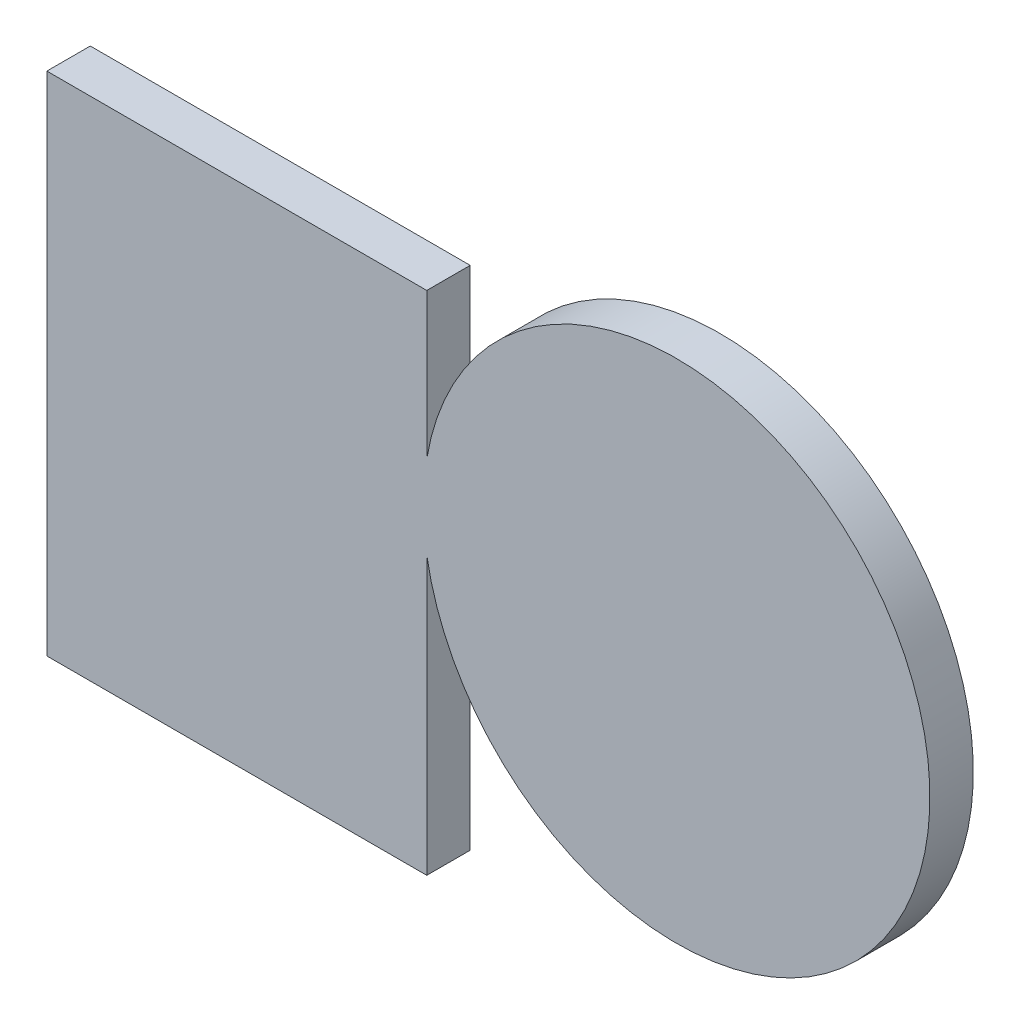
ISO-10303-21;
HEADER;
FILE_DESCRIPTION(('STEP AP214'),'2;1');
FILE_NAME('part.step','',(''),(''),'','','');
FILE_SCHEMA(('AUTOMOTIVE_DESIGN { 1 0 10303 214 1 1 1 1 }'));
ENDSEC;
DATA;
#1=APPLICATION_CONTEXT('core data for automotive mechanical design processes');
#2=APPLICATION_PROTOCOL_DEFINITION('international standard','automotive_design',2000,#1);
#3=PRODUCT_CONTEXT('',#1,'mechanical');
#4=PRODUCT('Part','Part','',(#3));
#5=PRODUCT_RELATED_PRODUCT_CATEGORY('part','',(#4));
#6=PRODUCT_DEFINITION_FORMATION('','',#4);
#7=PRODUCT_DEFINITION_CONTEXT('part definition',#1,'design');
#8=PRODUCT_DEFINITION('design','',#6,#7);
#9=PRODUCT_DEFINITION_SHAPE('','',#8);
#10=(LENGTH_UNIT() NAMED_UNIT(*) SI_UNIT(.MILLI.,.METRE.));
#11=(NAMED_UNIT(*) PLANE_ANGLE_UNIT() SI_UNIT($,.RADIAN.));
#12=(NAMED_UNIT(*) SI_UNIT($,.STERADIAN.) SOLID_ANGLE_UNIT());
#13=UNCERTAINTY_MEASURE_WITH_UNIT(LENGTH_MEASURE(1.E-05),#10,'distance_accuracy_value','');
#14=(GEOMETRIC_REPRESENTATION_CONTEXT(3) GLOBAL_UNCERTAINTY_ASSIGNED_CONTEXT((#13)) GLOBAL_UNIT_ASSIGNED_CONTEXT((#10,
#11,#12)) REPRESENTATION_CONTEXT('',''));
#15=CARTESIAN_POINT('',(0.,0.,0.));
#16=DIRECTION('',(0.,0.,1.));
#17=DIRECTION('',(1.,0.,0.));
#18=AXIS2_PLACEMENT_3D('',#15,#16,#17);
#19=CARTESIAN_POINT('',(11.183833351092,5.146378149327,0.76487));
#20=DIRECTION('',(0.,0.,-1.));
#21=DIRECTION('',(-1.,0.,0.));
#22=AXIS2_PLACEMENT_3D('',#19,#20,#21);
#23=PLANE('',#22);
#24=DIRECTION('',(0.,1.,0.));
#25=VECTOR('',#24,1.);
#26=CARTESIAN_POINT('',(11.1692,5.32318,0.76487));
#27=LINE('',#26,#25);
#28=CARTESIAN_POINT('',(11.1692,5.32318,0.76487));
#29=VERTEX_POINT('',#28);
#30=CARTESIAN_POINT('',(11.1692,5.20815252900009,0.76487));
#31=VERTEX_POINT('',#30);
#32=EDGE_CURVE('E68',#29,#31,#27,.F.);
#33=ORIENTED_EDGE('',*,*,#32,.T.);
#34=CARTESIAN_POINT('',(11.3665,5.175249984897,0.76487));
#35=DIRECTION('',(0.,0.,1.));
#36=DIRECTION('',(1.,0.,0.));
#37=AXIS2_PLACEMENT_3D('',#34,#35,#36);
#38=CIRCLE('',#37,0.200024667);
#39=CARTESIAN_POINT('',(11.1692,5.14234747099991,0.76487));
#40=VERTEX_POINT('',#39);
#41=EDGE_CURVE('E20',#40,#31,#38,.T.);
#42=ORIENTED_EDGE('',*,*,#41,.F.);
#43=DIRECTION('',(0.,1.,0.));
#44=VECTOR('',#43,1.);
#45=CARTESIAN_POINT('',(11.1692,5.142347471,0.76487));
#46=LINE('',#45,#44);
#47=CARTESIAN_POINT('',(11.1692,4.92318,0.76487));
#48=VERTEX_POINT('',#47);
#49=EDGE_CURVE('E101',#40,#48,#46,.F.);
#50=ORIENTED_EDGE('',*,*,#49,.T.);
#51=DIRECTION('',(1.,0.,0.));
#52=VECTOR('',#51,1.);
#53=CARTESIAN_POINT('',(11.1692,4.92318,0.76487));
#54=LINE('',#53,#52);
#55=CARTESIAN_POINT('',(10.8692,4.92318,0.76487));
#56=VERTEX_POINT('',#55);
#57=EDGE_CURVE('E95',#48,#56,#54,.F.);
#58=ORIENTED_EDGE('',*,*,#57,.T.);
#59=DIRECTION('',(0.,1.,0.));
#60=VECTOR('',#59,1.);
#61=CARTESIAN_POINT('',(10.8692,4.92318,0.76487));
#62=LINE('',#61,#60);
#63=CARTESIAN_POINT('',(10.8692,5.32318,0.76487));
#64=VERTEX_POINT('',#63);
#65=EDGE_CURVE('E105',#56,#64,#62,.T.);
#66=ORIENTED_EDGE('',*,*,#65,.T.);
#67=DIRECTION('',(1.,0.,0.));
#68=VECTOR('',#67,1.);
#69=CARTESIAN_POINT('',(10.8692,5.32318,0.76487));
#70=LINE('',#69,#68);
#71=EDGE_CURVE('E72',#64,#29,#70,.T.);
#72=ORIENTED_EDGE('',*,*,#71,.T.);
#73=EDGE_LOOP('',(#33,#42,#50,#58,#66,#72));
#74=FACE_BOUND('',#73,.T.);
#75=ADVANCED_FACE('F17',(#74),#23,.T.);
#76=CARTESIAN_POINT('',(11.3665,5.175249984897,0.76487));
#77=DIRECTION('',(0.,0.,1.));
#78=DIRECTION('',(1.,0.,0.));
#79=AXIS2_PLACEMENT_3D('',#76,#77,#78);
#80=CYLINDRICAL_SURFACE('',#79,0.200024667);
#81=ORIENTED_EDGE('',*,*,#41,.T.);
#82=DIRECTION('',(0.,0.,1.));
#83=VECTOR('',#82,1.);
#84=CARTESIAN_POINT('',(11.1692,5.208152529,0.76487));
#85=LINE('',#84,#83);
#86=CARTESIAN_POINT('',(11.1692,5.20815252900009,0.79916));
#87=VERTEX_POINT('',#86);
#88=EDGE_CURVE('E76',#31,#87,#85,.T.);
#89=ORIENTED_EDGE('',*,*,#88,.T.);
#90=CARTESIAN_POINT('',(11.3665,5.175250015103,0.79916));
#91=DIRECTION('',(0.,0.,1.));
#92=DIRECTION('',(1.,0.,0.));
#93=AXIS2_PLACEMENT_3D('',#90,#91,#92);
#94=CIRCLE('',#93,0.200024667);
#95=CARTESIAN_POINT('',(11.1692,5.14234747099991,0.79916));
#96=VERTEX_POINT('',#95);
#97=EDGE_CURVE('E112',#96,#87,#94,.T.);
#98=ORIENTED_EDGE('',*,*,#97,.F.);
#99=DIRECTION('',(0.,0.,1.));
#100=VECTOR('',#99,1.);
#101=CARTESIAN_POINT('',(11.1692,5.142347471,0.76487));
#102=LINE('',#101,#100);
#103=EDGE_CURVE('E83',#96,#40,#102,.F.);
#104=ORIENTED_EDGE('',*,*,#103,.T.);
#105=EDGE_LOOP('',(#81,#89,#98,#104));
#106=FACE_BOUND('',#105,.T.);
#107=ADVANCED_FACE('F80',(#106),#80,.T.);
#108=CARTESIAN_POINT('',(11.1692,5.32318,0.76487));
#109=DIRECTION('',(-1.,0.,0.));
#110=DIRECTION('',(0.,0.,1.));
#111=AXIS2_PLACEMENT_3D('',#108,#109,#110);
#112=PLANE('',#111);
#113=ORIENTED_EDGE('',*,*,#88,.F.);
#114=ORIENTED_EDGE('',*,*,#32,.F.);
#115=DIRECTION('',(0.,0.,-1.));
#116=VECTOR('',#115,1.);
#117=CARTESIAN_POINT('',(11.1692,5.32318,0.76487));
#118=LINE('',#117,#116);
#119=CARTESIAN_POINT('',(11.1692,5.32318,0.79916));
#120=VERTEX_POINT('',#119);
#121=EDGE_CURVE('E89',#29,#120,#118,.F.);
#122=ORIENTED_EDGE('',*,*,#121,.T.);
#123=DIRECTION('',(0.,-1.,0.));
#124=VECTOR('',#123,1.);
#125=CARTESIAN_POINT('',(11.1692,5.146378149327,0.79916));
#126=LINE('',#125,#124);
#127=EDGE_CURVE('E87',#87,#120,#126,.F.);
#128=ORIENTED_EDGE('',*,*,#127,.F.);
#129=EDGE_LOOP('',(#113,#114,#122,#128));
#130=FACE_BOUND('',#129,.T.);
#131=ADVANCED_FACE('F85',(#130),#112,.F.);
#132=CARTESIAN_POINT('',(10.8692,5.32318,0.76487));
#133=DIRECTION('',(0.,-1.,0.));
#134=DIRECTION('',(0.,0.,-1.));
#135=AXIS2_PLACEMENT_3D('',#132,#133,#134);
#136=PLANE('',#135);
#137=ORIENTED_EDGE('',*,*,#121,.F.);
#138=ORIENTED_EDGE('',*,*,#71,.F.);
#139=DIRECTION('',(0.,0.,1.));
#140=VECTOR('',#139,1.);
#141=CARTESIAN_POINT('',(10.8692,5.32318,0.76487));
#142=LINE('',#141,#140);
#143=CARTESIAN_POINT('',(10.8692,5.32318,0.79916));
#144=VERTEX_POINT('',#143);
#145=EDGE_CURVE('E98',#64,#144,#142,.T.);
#146=ORIENTED_EDGE('',*,*,#145,.T.);
#147=DIRECTION('',(1.,0.,0.));
#148=VECTOR('',#147,1.);
#149=CARTESIAN_POINT('',(11.183833351092,5.32318,0.79916));
#150=LINE('',#149,#148);
#151=EDGE_CURVE('E114',#120,#144,#150,.F.);
#152=ORIENTED_EDGE('',*,*,#151,.F.);
#153=EDGE_LOOP('',(#137,#138,#146,#152));
#154=FACE_BOUND('',#153,.T.);
#155=ADVANCED_FACE('F142',(#154),#136,.F.);
#156=CARTESIAN_POINT('',(10.8692,4.92318,0.76487));
#157=DIRECTION('',(1.,0.,0.));
#158=DIRECTION('',(0.,1.,0.));
#159=AXIS2_PLACEMENT_3D('',#156,#157,#158);
#160=PLANE('',#159);
#161=ORIENTED_EDGE('',*,*,#145,.F.);
#162=ORIENTED_EDGE('',*,*,#65,.F.);
#163=DIRECTION('',(0.,0.,1.));
#164=VECTOR('',#163,1.);
#165=CARTESIAN_POINT('',(10.8692,4.92318,0.76487));
#166=LINE('',#165,#164);
#167=CARTESIAN_POINT('',(10.8692,4.92318,0.79916));
#168=VERTEX_POINT('',#167);
#169=EDGE_CURVE('E97',#56,#168,#166,.T.);
#170=ORIENTED_EDGE('',*,*,#169,.T.);
#171=DIRECTION('',(0.,-1.,0.));
#172=VECTOR('',#171,1.);
#173=CARTESIAN_POINT('',(10.8692,5.146378149327,0.79916));
#174=LINE('',#173,#172);
#175=EDGE_CURVE('E124',#144,#168,#174,.T.);
#176=ORIENTED_EDGE('',*,*,#175,.F.);
#177=EDGE_LOOP('',(#161,#162,#170,#176));
#178=FACE_BOUND('',#177,.T.);
#179=ADVANCED_FACE('F159',(#178),#160,.F.);
#180=CARTESIAN_POINT('',(11.1692,4.92318,0.76487));
#181=DIRECTION('',(0.,1.,0.));
#182=DIRECTION('',(0.,0.,1.));
#183=AXIS2_PLACEMENT_3D('',#180,#181,#182);
#184=PLANE('',#183);
#185=ORIENTED_EDGE('',*,*,#169,.F.);
#186=ORIENTED_EDGE('',*,*,#57,.F.);
#187=DIRECTION('',(0.,0.,1.));
#188=VECTOR('',#187,1.);
#189=CARTESIAN_POINT('',(11.1692,4.92318,0.76487));
#190=LINE('',#189,#188);
#191=CARTESIAN_POINT('',(11.1692,4.92318,0.79916));
#192=VERTEX_POINT('',#191);
#193=EDGE_CURVE('E35',#48,#192,#190,.T.);
#194=ORIENTED_EDGE('',*,*,#193,.T.);
#195=DIRECTION('',(1.,0.,0.));
#196=VECTOR('',#195,1.);
#197=CARTESIAN_POINT('',(11.183833351092,4.92318,0.79916));
#198=LINE('',#197,#196);
#199=EDGE_CURVE('E26',#168,#192,#198,.T.);
#200=ORIENTED_EDGE('',*,*,#199,.F.);
#201=EDGE_LOOP('',(#185,#186,#194,#200));
#202=FACE_BOUND('',#201,.T.);
#203=ADVANCED_FACE('F153',(#202),#184,.F.);
#204=CARTESIAN_POINT('',(11.1692,5.142347471,0.76487));
#205=DIRECTION('',(-1.,0.,0.));
#206=DIRECTION('',(0.,0.,1.));
#207=AXIS2_PLACEMENT_3D('',#204,#205,#206);
#208=PLANE('',#207);
#209=ORIENTED_EDGE('',*,*,#193,.F.);
#210=ORIENTED_EDGE('',*,*,#49,.F.);
#211=ORIENTED_EDGE('',*,*,#103,.F.);
#212=DIRECTION('',(0.,-1.,0.));
#213=VECTOR('',#212,1.);
#214=CARTESIAN_POINT('',(11.1692,5.146378149327,0.79916));
#215=LINE('',#214,#213);
#216=EDGE_CURVE('E11',#192,#96,#215,.F.);
#217=ORIENTED_EDGE('',*,*,#216,.F.);
#218=EDGE_LOOP('',(#209,#210,#211,#217));
#219=FACE_BOUND('',#218,.T.);
#220=ADVANCED_FACE('F147',(#219),#208,.F.);
#221=CARTESIAN_POINT('',(11.183833351092,5.146378149327,0.79916));
#222=DIRECTION('',(0.,0.,1.));
#223=DIRECTION('',(0.,-1.,0.));
#224=AXIS2_PLACEMENT_3D('',#221,#222,#223);
#225=PLANE('',#224);
#226=ORIENTED_EDGE('',*,*,#199,.T.);
#227=ORIENTED_EDGE('',*,*,#216,.T.);
#228=ORIENTED_EDGE('',*,*,#97,.T.);
#229=ORIENTED_EDGE('',*,*,#127,.T.);
#230=ORIENTED_EDGE('',*,*,#151,.T.);
#231=ORIENTED_EDGE('',*,*,#175,.T.);
#232=EDGE_LOOP('',(#226,#227,#228,#229,#230,#231));
#233=FACE_BOUND('',#232,.T.);
#234=ADVANCED_FACE('F145',(#233),#225,.T.);
#235=CLOSED_SHELL('',(#75,#107,#131,#155,#179,#203,#220,#234));
#236=MANIFOLD_SOLID_BREP('B1',#235);
#237=ADVANCED_BREP_SHAPE_REPRESENTATION('',(#18,#236),#14);
#238=SHAPE_DEFINITION_REPRESENTATION(#9,#237);
ENDSEC;
END-ISO-10303-21;
